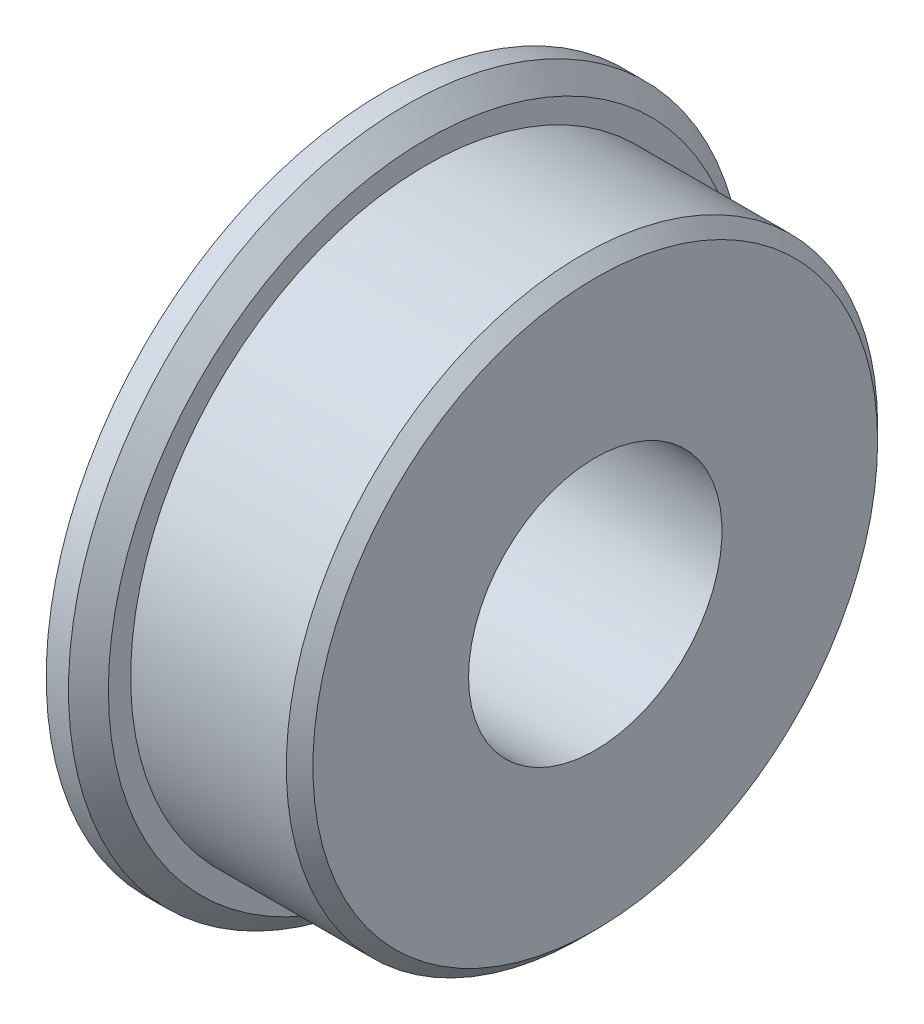
ISO-10303-21;
HEADER;
FILE_DESCRIPTION(('STEP AP214'),'2;1');
FILE_NAME('part.step','',(''),(''),'','','');
FILE_SCHEMA(('AUTOMOTIVE_DESIGN { 1 0 10303 214 1 1 1 1 }'));
ENDSEC;
DATA;
#1=APPLICATION_CONTEXT('core data for automotive mechanical design processes');
#2=APPLICATION_PROTOCOL_DEFINITION('international standard','automotive_design',2000,#1);
#3=PRODUCT_CONTEXT('',#1,'mechanical');
#4=PRODUCT('Part','Part','',(#3));
#5=PRODUCT_RELATED_PRODUCT_CATEGORY('part','',(#4));
#6=PRODUCT_DEFINITION_FORMATION('','',#4);
#7=PRODUCT_DEFINITION_CONTEXT('part definition',#1,'design');
#8=PRODUCT_DEFINITION('design','',#6,#7);
#9=PRODUCT_DEFINITION_SHAPE('','',#8);
#10=(LENGTH_UNIT() NAMED_UNIT(*) SI_UNIT(.MILLI.,.METRE.));
#11=(NAMED_UNIT(*) PLANE_ANGLE_UNIT() SI_UNIT($,.RADIAN.));
#12=(NAMED_UNIT(*) SI_UNIT($,.STERADIAN.) SOLID_ANGLE_UNIT());
#13=UNCERTAINTY_MEASURE_WITH_UNIT(LENGTH_MEASURE(1.E-05),#10,'distance_accuracy_value','');
#14=(GEOMETRIC_REPRESENTATION_CONTEXT(3) GLOBAL_UNCERTAINTY_ASSIGNED_CONTEXT((#13)) GLOBAL_UNIT_ASSIGNED_CONTEXT((#10,
#11,#12)) REPRESENTATION_CONTEXT('',''));
#15=CARTESIAN_POINT('',(0.,0.,0.));
#16=DIRECTION('',(0.,0.,1.));
#17=DIRECTION('',(1.,0.,0.));
#18=AXIS2_PLACEMENT_3D('',#15,#16,#17);
#19=CARTESIAN_POINT('',(3.175,0.,0.));
#20=DIRECTION('',(-1.,0.,0.));
#21=DIRECTION('',(0.,0.,1.));
#22=AXIS2_PLACEMENT_3D('',#19,#20,#21);
#23=CYLINDRICAL_SURFACE('',#22,25.4);
#24=CARTESIAN_POINT('',(1.675,0.,0.));
#25=DIRECTION('',(1.,0.,0.));
#26=DIRECTION('',(0.,0.,-1.));
#27=AXIS2_PLACEMENT_3D('',#24,#25,#26);
#28=CIRCLE('',#27,25.4);
#29=CARTESIAN_POINT('',(1.675,0.,-25.4));
#30=VERTEX_POINT('',#29);
#31=EDGE_CURVE('E52',#30,#30,#28,.F.);
#32=ORIENTED_EDGE('',*,*,#31,.T.);
#33=EDGE_LOOP('',(#32));
#34=FACE_BOUND('',#33,.T.);
#35=CARTESIAN_POINT('',(0.,0.,0.));
#36=DIRECTION('',(1.,0.,0.));
#37=DIRECTION('',(0.,0.,-1.));
#38=AXIS2_PLACEMENT_3D('',#35,#36,#37);
#39=CIRCLE('',#38,25.4);
#40=CARTESIAN_POINT('',(0.,0.,-25.4));
#41=VERTEX_POINT('',#40);
#42=EDGE_CURVE('E64',#41,#41,#39,.T.);
#43=ORIENTED_EDGE('',*,*,#42,.T.);
#44=EDGE_LOOP('',(#43));
#45=FACE_BOUND('',#44,.T.);
#46=ADVANCED_FACE('F38',(#34,#45),#23,.T.);
#47=CARTESIAN_POINT('',(3.175,0.,0.));
#48=DIRECTION('',(1.,0.,0.));
#49=DIRECTION('',(0.,0.,-1.));
#50=AXIS2_PLACEMENT_3D('',#47,#48,#49);
#51=PLANE('',#50);
#52=CARTESIAN_POINT('',(3.175,0.,0.));
#53=DIRECTION('',(1.,0.,0.));
#54=DIRECTION('',(0.,0.,-1.));
#55=AXIS2_PLACEMENT_3D('',#52,#53,#54);
#56=CIRCLE('',#55,23.9);
#57=CARTESIAN_POINT('',(3.175,0.,-23.9));
#58=VERTEX_POINT('',#57);
#59=EDGE_CURVE('E57',#58,#58,#56,.T.);
#60=ORIENTED_EDGE('',*,*,#59,.T.);
#61=EDGE_LOOP('',(#60));
#62=FACE_BOUND('',#61,.T.);
#63=CARTESIAN_POINT('',(3.175,0.,0.));
#64=DIRECTION('',(1.,0.,0.));
#65=DIRECTION('',(0.,0.,-1.));
#66=AXIS2_PLACEMENT_3D('',#63,#64,#65);
#67=CIRCLE('',#66,22.225);
#68=CARTESIAN_POINT('',(3.175,0.,-22.225));
#69=VERTEX_POINT('',#68);
#70=EDGE_CURVE('E63',#69,#69,#67,.T.);
#71=ORIENTED_EDGE('',*,*,#70,.F.);
#72=EDGE_LOOP('',(#71));
#73=FACE_BOUND('',#72,.T.);
#74=ADVANCED_FACE('F93',(#62,#73),#51,.T.);
#75=CARTESIAN_POINT('',(0.,0.,0.));
#76=DIRECTION('',(1.,0.,0.));
#77=DIRECTION('',(0.,0.,-1.));
#78=AXIS2_PLACEMENT_3D('',#75,#76,#77);
#79=PLANE('',#78);
#80=CARTESIAN_POINT('',(0.,0.,0.));
#81=DIRECTION('',(-1.,0.,0.));
#82=DIRECTION('',(0.,0.,1.));
#83=AXIS2_PLACEMENT_3D('',#80,#81,#82);
#84=CIRCLE('',#83,9.525);
#85=CARTESIAN_POINT('',(0.,0.,9.525));
#86=VERTEX_POINT('',#85);
#87=EDGE_CURVE('E72',#86,#86,#84,.T.);
#88=ORIENTED_EDGE('',*,*,#87,.F.);
#89=EDGE_LOOP('',(#88));
#90=FACE_BOUND('',#89,.T.);
#91=ORIENTED_EDGE('',*,*,#42,.F.);
#92=EDGE_LOOP('',(#91));
#93=FACE_BOUND('',#92,.T.);
#94=ADVANCED_FACE('F89',(#90,#93),#79,.F.);
#95=CARTESIAN_POINT('',(15.875,0.,0.));
#96=DIRECTION('',(-1.,0.,0.));
#97=DIRECTION('',(0.,0.,1.));
#98=AXIS2_PLACEMENT_3D('',#95,#96,#97);
#99=CYLINDRICAL_SURFACE('',#98,22.225);
#100=CARTESIAN_POINT('',(14.875,0.,0.));
#101=DIRECTION('',(1.,0.,0.));
#102=DIRECTION('',(0.,0.,-1.));
#103=AXIS2_PLACEMENT_3D('',#100,#101,#102);
#104=CIRCLE('',#103,22.225);
#105=CARTESIAN_POINT('',(14.875,0.,-22.225));
#106=VERTEX_POINT('',#105);
#107=EDGE_CURVE('E10',#106,#106,#104,.F.);
#108=ORIENTED_EDGE('',*,*,#107,.T.);
#109=EDGE_LOOP('',(#108));
#110=FACE_BOUND('',#109,.T.);
#111=ORIENTED_EDGE('',*,*,#70,.T.);
#112=EDGE_LOOP('',(#111));
#113=FACE_BOUND('',#112,.T.);
#114=ADVANCED_FACE('F92',(#110,#113),#99,.T.);
#115=CARTESIAN_POINT('',(15.875,0.,0.));
#116=DIRECTION('',(1.,0.,0.));
#117=DIRECTION('',(0.,0.,-1.));
#118=AXIS2_PLACEMENT_3D('',#115,#116,#117);
#119=PLANE('',#118);
#120=CARTESIAN_POINT('',(15.875,0.,0.));
#121=DIRECTION('',(1.,0.,0.));
#122=DIRECTION('',(0.,0.,-1.));
#123=AXIS2_PLACEMENT_3D('',#120,#121,#122);
#124=CIRCLE('',#123,21.225);
#125=CARTESIAN_POINT('',(15.875,0.,-21.225));
#126=VERTEX_POINT('',#125);
#127=EDGE_CURVE('E47',#126,#126,#124,.T.);
#128=ORIENTED_EDGE('',*,*,#127,.T.);
#129=EDGE_LOOP('',(#128));
#130=FACE_BOUND('',#129,.T.);
#131=CARTESIAN_POINT('',(15.875,0.,0.));
#132=DIRECTION('',(-1.,0.,0.));
#133=DIRECTION('',(0.,0.,1.));
#134=AXIS2_PLACEMENT_3D('',#131,#132,#133);
#135=CIRCLE('',#134,9.525);
#136=CARTESIAN_POINT('',(15.875,0.,9.525));
#137=VERTEX_POINT('',#136);
#138=EDGE_CURVE('E68',#137,#137,#135,.T.);
#139=ORIENTED_EDGE('',*,*,#138,.T.);
#140=EDGE_LOOP('',(#139));
#141=FACE_BOUND('',#140,.T.);
#142=ADVANCED_FACE('F80',(#130,#141),#119,.T.);
#143=CARTESIAN_POINT('',(15.875,0.,0.));
#144=DIRECTION('',(-1.,0.,0.));
#145=DIRECTION('',(0.,0.,1.));
#146=AXIS2_PLACEMENT_3D('',#143,#144,#145);
#147=CYLINDRICAL_SURFACE('',#146,9.525);
#148=ORIENTED_EDGE('',*,*,#138,.F.);
#149=EDGE_LOOP('',(#148));
#150=FACE_BOUND('',#149,.T.);
#151=ORIENTED_EDGE('',*,*,#87,.T.);
#152=EDGE_LOOP('',(#151));
#153=FACE_BOUND('',#152,.T.);
#154=ADVANCED_FACE('F82',(#150,#153),#147,.F.);
#155=CARTESIAN_POINT('',(3.175,0.,0.));
#156=DIRECTION('',(-1.,0.,0.));
#157=DIRECTION('',(0.,0.,1.));
#158=AXIS2_PLACEMENT_3D('',#155,#156,#157);
#159=CONICAL_SURFACE('',#158,23.9,0.785398163397443);
#160=ORIENTED_EDGE('',*,*,#31,.F.);
#161=EDGE_LOOP('',(#160));
#162=FACE_BOUND('',#161,.T.);
#163=ORIENTED_EDGE('',*,*,#59,.F.);
#164=EDGE_LOOP('',(#163));
#165=FACE_BOUND('',#164,.T.);
#166=ADVANCED_FACE('F85',(#162,#165),#159,.T.);
#167=CARTESIAN_POINT('',(15.875,0.,0.));
#168=DIRECTION('',(-1.,0.,0.));
#169=DIRECTION('',(0.,0.,1.));
#170=AXIS2_PLACEMENT_3D('',#167,#168,#169);
#171=CONICAL_SURFACE('',#170,21.225,0.785398163397445);
#172=ORIENTED_EDGE('',*,*,#107,.F.);
#173=EDGE_LOOP('',(#172));
#174=FACE_BOUND('',#173,.T.);
#175=ORIENTED_EDGE('',*,*,#127,.F.);
#176=EDGE_LOOP('',(#175));
#177=FACE_BOUND('',#176,.T.);
#178=ADVANCED_FACE('F41',(#174,#177),#171,.T.);
#179=CLOSED_SHELL('',(#46,#74,#94,#114,#142,#154,#166,#178));
#180=MANIFOLD_SOLID_BREP('B2',#179);
#181=ADVANCED_BREP_SHAPE_REPRESENTATION('',(#18,#180),#14);
#182=SHAPE_DEFINITION_REPRESENTATION(#9,#181);
ENDSEC;
END-ISO-10303-21;
